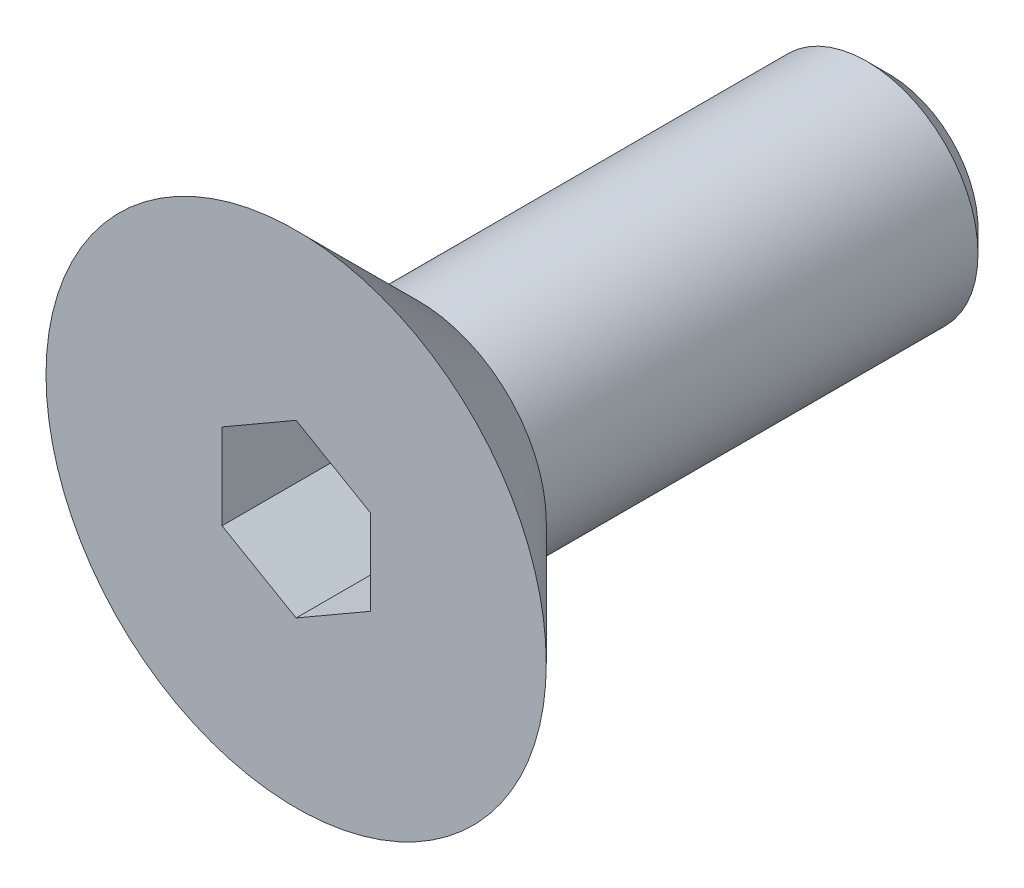
ISO-10303-21;
HEADER;
FILE_DESCRIPTION(('STEP AP214'),'2;1');
FILE_NAME('part.step','',(''),(''),'','','');
FILE_SCHEMA(('AUTOMOTIVE_DESIGN { 1 0 10303 214 1 1 1 1 }'));
ENDSEC;
DATA;
#1=APPLICATION_CONTEXT('core data for automotive mechanical design processes');
#2=APPLICATION_PROTOCOL_DEFINITION('international standard','automotive_design',2000,#1);
#3=PRODUCT_CONTEXT('',#1,'mechanical');
#4=PRODUCT('Part','Part','',(#3));
#5=PRODUCT_RELATED_PRODUCT_CATEGORY('part','',(#4));
#6=PRODUCT_DEFINITION_FORMATION('','',#4);
#7=PRODUCT_DEFINITION_CONTEXT('part definition',#1,'design');
#8=PRODUCT_DEFINITION('design','',#6,#7);
#9=PRODUCT_DEFINITION_SHAPE('','',#8);
#10=(LENGTH_UNIT() NAMED_UNIT(*) SI_UNIT(.MILLI.,.METRE.));
#11=(NAMED_UNIT(*) PLANE_ANGLE_UNIT() SI_UNIT($,.RADIAN.));
#12=(NAMED_UNIT(*) SI_UNIT($,.STERADIAN.) SOLID_ANGLE_UNIT());
#13=UNCERTAINTY_MEASURE_WITH_UNIT(LENGTH_MEASURE(1.E-05),#10,'distance_accuracy_value','');
#14=(GEOMETRIC_REPRESENTATION_CONTEXT(3) GLOBAL_UNCERTAINTY_ASSIGNED_CONTEXT((#13)) GLOBAL_UNIT_ASSIGNED_CONTEXT((#10,
#11,#12)) REPRESENTATION_CONTEXT('',''));
#15=CARTESIAN_POINT('',(0.,0.,0.));
#16=DIRECTION('',(0.,0.,1.));
#17=DIRECTION('',(1.,0.,0.));
#18=AXIS2_PLACEMENT_3D('',#15,#16,#17);
#19=CARTESIAN_POINT('',(0.,0.,0.));
#20=DIRECTION('',(0.,0.,1.));
#21=DIRECTION('',(1.,0.,0.));
#22=AXIS2_PLACEMENT_3D('',#19,#20,#21);
#23=PLANE('',#22);
#24=CARTESIAN_POINT('',(0.,0.,0.));
#25=DIRECTION('',(0.,0.,1.));
#26=DIRECTION('',(1.,0.,0.));
#27=AXIS2_PLACEMENT_3D('',#24,#25,#26);
#28=CIRCLE('',#27,1.725);
#29=CARTESIAN_POINT('',(1.725,0.,0.));
#30=VERTEX_POINT('',#29);
#31=EDGE_CURVE('E11',#30,#30,#28,.F.);
#32=ORIENTED_EDGE('',*,*,#31,.T.);
#33=EDGE_LOOP('',(#32));
#34=FACE_BOUND('',#33,.T.);
#35=CARTESIAN_POINT('',(0.,0.,0.));
#36=DIRECTION('',(0.,0.,1.));
#37=DIRECTION('',(1.,0.,0.));
#38=AXIS2_PLACEMENT_3D('',#35,#36,#37);
#39=CIRCLE('',#38,1.5);
#40=CARTESIAN_POINT('',(1.5,0.,0.));
#41=VERTEX_POINT('',#40);
#42=EDGE_CURVE('E144',#41,#41,#39,.F.);
#43=ORIENTED_EDGE('',*,*,#42,.F.);
#44=EDGE_LOOP('',(#43));
#45=FACE_BOUND('',#44,.T.);
#46=ADVANCED_FACE('F34',(#34,#45),#23,.F.);
#47=CARTESIAN_POINT('',(0.,0.,1.65));
#48=DIRECTION('',(0.,0.,1.));
#49=DIRECTION('',(1.,0.,0.));
#50=AXIS2_PLACEMENT_3D('',#47,#48,#49);
#51=PLANE('',#50);
#52=DIRECTION('',(-0.866025403784439,0.5,0.));
#53=VECTOR('',#52,1.);
#54=CARTESIAN_POINT('',(1.,0.577350269189626,1.65));
#55=LINE('',#54,#53);
#56=CARTESIAN_POINT('',(1.,0.577350269189626,1.65));
#57=VERTEX_POINT('',#56);
#58=CARTESIAN_POINT('',(0.,1.15470053837925,1.65));
#59=VERTEX_POINT('',#58);
#60=EDGE_CURVE('E49',#57,#59,#55,.T.);
#61=ORIENTED_EDGE('',*,*,#60,.F.);
#62=DIRECTION('',(0.,1.,0.));
#63=VECTOR('',#62,1.);
#64=CARTESIAN_POINT('',(1.,-0.577350269189626,1.65));
#65=LINE('',#64,#63);
#66=CARTESIAN_POINT('',(1.,-0.577350269189626,1.65));
#67=VERTEX_POINT('',#66);
#68=EDGE_CURVE('E132',#67,#57,#65,.T.);
#69=ORIENTED_EDGE('',*,*,#68,.F.);
#70=DIRECTION('',(0.866025403784439,0.5,0.));
#71=VECTOR('',#70,1.);
#72=CARTESIAN_POINT('',(0.,-1.15470053837925,1.65));
#73=LINE('',#72,#71);
#74=CARTESIAN_POINT('',(0.,-1.15470053837925,1.65));
#75=VERTEX_POINT('',#74);
#76=EDGE_CURVE('E130',#75,#67,#73,.T.);
#77=ORIENTED_EDGE('',*,*,#76,.F.);
#78=DIRECTION('',(0.866025403784439,-0.5,0.));
#79=VECTOR('',#78,1.);
#80=CARTESIAN_POINT('',(-1.,-0.577350269189626,1.65));
#81=LINE('',#80,#79);
#82=CARTESIAN_POINT('',(-1.,-0.577350269189626,1.65));
#83=VERTEX_POINT('',#82);
#84=EDGE_CURVE('E97',#83,#75,#81,.T.);
#85=ORIENTED_EDGE('',*,*,#84,.F.);
#86=DIRECTION('',(0.,-1.,0.));
#87=VECTOR('',#86,1.);
#88=CARTESIAN_POINT('',(-1.,0.577350269189626,1.65));
#89=LINE('',#88,#87);
#90=CARTESIAN_POINT('',(-1.,0.577350269189626,1.65));
#91=VERTEX_POINT('',#90);
#92=EDGE_CURVE('E126',#91,#83,#89,.T.);
#93=ORIENTED_EDGE('',*,*,#92,.F.);
#94=DIRECTION('',(-0.866025403784439,-0.5,0.));
#95=VECTOR('',#94,1.);
#96=CARTESIAN_POINT('',(0.,1.15470053837925,1.65));
#97=LINE('',#96,#95);
#98=EDGE_CURVE('E123',#59,#91,#97,.T.);
#99=ORIENTED_EDGE('',*,*,#98,.F.);
#100=EDGE_LOOP('',(#61,#69,#77,#85,#93,#99));
#101=FACE_BOUND('',#100,.T.);
#102=CARTESIAN_POINT('',(0.,0.,1.65));
#103=DIRECTION('',(0.,0.,1.));
#104=DIRECTION('',(1.,0.,0.));
#105=AXIS2_PLACEMENT_3D('',#102,#103,#104);
#106=CIRCLE('',#105,3.375);
#107=CARTESIAN_POINT('',(3.375,0.,1.65));
#108=VERTEX_POINT('',#107);
#109=EDGE_CURVE('E136',#108,#108,#106,.T.);
#110=ORIENTED_EDGE('',*,*,#109,.T.);
#111=EDGE_LOOP('',(#110));
#112=FACE_BOUND('',#111,.T.);
#113=ADVANCED_FACE('F167',(#101,#112),#51,.T.);
#114=CARTESIAN_POINT('',(0.,0.,-6.35));
#115=DIRECTION('',(0.,0.,1.));
#116=DIRECTION('',(1.,0.,0.));
#117=AXIS2_PLACEMENT_3D('',#114,#115,#116);
#118=CYLINDRICAL_SURFACE('',#117,1.5);
#119=CARTESIAN_POINT('',(0.,0.,-6.05));
#120=DIRECTION('',(0.,0.,-1.));
#121=DIRECTION('',(-1.,0.,0.));
#122=AXIS2_PLACEMENT_3D('',#119,#120,#121);
#123=CIRCLE('',#122,1.5);
#124=CARTESIAN_POINT('',(-1.5,0.,-6.05));
#125=VERTEX_POINT('',#124);
#126=EDGE_CURVE('E42',#125,#125,#123,.F.);
#127=ORIENTED_EDGE('',*,*,#126,.T.);
#128=EDGE_LOOP('',(#127));
#129=FACE_BOUND('',#128,.T.);
#130=ORIENTED_EDGE('',*,*,#42,.T.);
#131=EDGE_LOOP('',(#130));
#132=FACE_BOUND('',#131,.T.);
#133=ADVANCED_FACE('F152',(#129,#132),#118,.T.);
#134=CARTESIAN_POINT('',(0.,0.,-6.35));
#135=DIRECTION('',(0.,0.,-1.));
#136=DIRECTION('',(-1.,0.,0.));
#137=AXIS2_PLACEMENT_3D('',#134,#135,#136);
#138=PLANE('',#137);
#139=CARTESIAN_POINT('',(0.,0.,-6.35));
#140=DIRECTION('',(0.,0.,-1.));
#141=DIRECTION('',(-1.,0.,0.));
#142=AXIS2_PLACEMENT_3D('',#139,#140,#141);
#143=CIRCLE('',#142,1.2);
#144=CARTESIAN_POINT('',(-1.2,0.,-6.35));
#145=VERTEX_POINT('',#144);
#146=EDGE_CURVE('E147',#145,#145,#143,.T.);
#147=ORIENTED_EDGE('',*,*,#146,.T.);
#148=EDGE_LOOP('',(#147));
#149=FACE_BOUND('',#148,.T.);
#150=ADVANCED_FACE('F159',(#149),#138,.T.);
#151=CARTESIAN_POINT('',(0.,0.,-6.35));
#152=DIRECTION('',(0.,0.,1.));
#153=DIRECTION('',(1.,0.,0.));
#154=AXIS2_PLACEMENT_3D('',#151,#152,#153);
#155=CONICAL_SURFACE('',#154,1.2,0.785398163397447);
#156=ORIENTED_EDGE('',*,*,#126,.F.);
#157=EDGE_LOOP('',(#156));
#158=FACE_BOUND('',#157,.T.);
#159=ORIENTED_EDGE('',*,*,#146,.F.);
#160=EDGE_LOOP('',(#159));
#161=FACE_BOUND('',#160,.T.);
#162=ADVANCED_FACE('F155',(#158,#161),#155,.T.);
#163=CARTESIAN_POINT('',(1.,0.577350269189626,-0.35));
#164=DIRECTION('',(0.5,0.866025403784439,0.));
#165=DIRECTION('',(-0.866025403784439,0.5,0.));
#166=AXIS2_PLACEMENT_3D('',#163,#164,#165);
#167=PLANE('',#166);
#168=ORIENTED_EDGE('',*,*,#60,.T.);
#169=DIRECTION('',(0.,0.,1.));
#170=VECTOR('',#169,1.);
#171=CARTESIAN_POINT('',(0.,1.15470053837925,-0.35));
#172=LINE('',#171,#170);
#173=CARTESIAN_POINT('',(0.,1.15470053837925,-0.35));
#174=VERTEX_POINT('',#173);
#175=EDGE_CURVE('E79',#174,#59,#172,.T.);
#176=ORIENTED_EDGE('',*,*,#175,.F.);
#177=DIRECTION('',(-0.866025403784439,0.5,0.));
#178=VECTOR('',#177,1.);
#179=CARTESIAN_POINT('',(1.,0.577350269189626,-0.35));
#180=LINE('',#179,#178);
#181=CARTESIAN_POINT('',(1.,0.577350269189626,-0.35));
#182=VERTEX_POINT('',#181);
#183=EDGE_CURVE('E134',#182,#174,#180,.T.);
#184=ORIENTED_EDGE('',*,*,#183,.F.);
#185=DIRECTION('',(0.,0.,1.));
#186=VECTOR('',#185,1.);
#187=CARTESIAN_POINT('',(1.,0.577350269189626,-0.35));
#188=LINE('',#187,#186);
#189=EDGE_CURVE('E57',#182,#57,#188,.T.);
#190=ORIENTED_EDGE('',*,*,#189,.T.);
#191=EDGE_LOOP('',(#168,#176,#184,#190));
#192=FACE_BOUND('',#191,.T.);
#193=ADVANCED_FACE('F158',(#192),#167,.F.);
#194=CARTESIAN_POINT('',(1.,-0.577350269189626,-0.35));
#195=DIRECTION('',(1.,0.,0.));
#196=DIRECTION('',(0.,1.,0.));
#197=AXIS2_PLACEMENT_3D('',#194,#195,#196);
#198=PLANE('',#197);
#199=ORIENTED_EDGE('',*,*,#68,.T.);
#200=ORIENTED_EDGE('',*,*,#189,.F.);
#201=DIRECTION('',(0.,1.,0.));
#202=VECTOR('',#201,1.);
#203=CARTESIAN_POINT('',(1.,-0.577350269189626,-0.35));
#204=LINE('',#203,#202);
#205=CARTESIAN_POINT('',(1.,-0.577350269189626,-0.35));
#206=VERTEX_POINT('',#205);
#207=EDGE_CURVE('E109',#206,#182,#204,.T.);
#208=ORIENTED_EDGE('',*,*,#207,.F.);
#209=DIRECTION('',(0.,0.,1.));
#210=VECTOR('',#209,1.);
#211=CARTESIAN_POINT('',(1.,-0.577350269189626,-0.35));
#212=LINE('',#211,#210);
#213=EDGE_CURVE('E101',#206,#67,#212,.T.);
#214=ORIENTED_EDGE('',*,*,#213,.T.);
#215=EDGE_LOOP('',(#199,#200,#208,#214));
#216=FACE_BOUND('',#215,.T.);
#217=ADVANCED_FACE('F198',(#216),#198,.F.);
#218=CARTESIAN_POINT('',(0.,-1.15470053837925,-0.35));
#219=DIRECTION('',(0.5,-0.866025403784439,0.));
#220=DIRECTION('',(0.866025403784439,0.5,0.));
#221=AXIS2_PLACEMENT_3D('',#218,#219,#220);
#222=PLANE('',#221);
#223=ORIENTED_EDGE('',*,*,#76,.T.);
#224=ORIENTED_EDGE('',*,*,#213,.F.);
#225=DIRECTION('',(0.866025403784439,0.5,0.));
#226=VECTOR('',#225,1.);
#227=CARTESIAN_POINT('',(0.,-1.15470053837925,-0.35));
#228=LINE('',#227,#226);
#229=CARTESIAN_POINT('',(0.,-1.15470053837925,-0.35));
#230=VERTEX_POINT('',#229);
#231=EDGE_CURVE('E105',#230,#206,#228,.T.);
#232=ORIENTED_EDGE('',*,*,#231,.F.);
#233=DIRECTION('',(0.,0.,1.));
#234=VECTOR('',#233,1.);
#235=CARTESIAN_POINT('',(0.,-1.15470053837925,-0.35));
#236=LINE('',#235,#234);
#237=EDGE_CURVE('E90',#230,#75,#236,.T.);
#238=ORIENTED_EDGE('',*,*,#237,.T.);
#239=EDGE_LOOP('',(#223,#224,#232,#238));
#240=FACE_BOUND('',#239,.T.);
#241=ADVANCED_FACE('F106',(#240),#222,.F.);
#242=CARTESIAN_POINT('',(-1.,-0.577350269189626,-0.35));
#243=DIRECTION('',(-0.5,-0.866025403784439,0.));
#244=DIRECTION('',(0.866025403784439,-0.5,0.));
#245=AXIS2_PLACEMENT_3D('',#242,#243,#244);
#246=PLANE('',#245);
#247=ORIENTED_EDGE('',*,*,#84,.T.);
#248=ORIENTED_EDGE('',*,*,#237,.F.);
#249=DIRECTION('',(0.866025403784439,-0.5,0.));
#250=VECTOR('',#249,1.);
#251=CARTESIAN_POINT('',(-1.,-0.577350269189626,-0.35));
#252=LINE('',#251,#250);
#253=CARTESIAN_POINT('',(-1.,-0.577350269189626,-0.35));
#254=VERTEX_POINT('',#253);
#255=EDGE_CURVE('E94',#254,#230,#252,.T.);
#256=ORIENTED_EDGE('',*,*,#255,.F.);
#257=DIRECTION('',(0.,0.,1.));
#258=VECTOR('',#257,1.);
#259=CARTESIAN_POINT('',(-1.,-0.577350269189626,-0.35));
#260=LINE('',#259,#258);
#261=EDGE_CURVE('E102',#254,#83,#260,.T.);
#262=ORIENTED_EDGE('',*,*,#261,.T.);
#263=EDGE_LOOP('',(#247,#248,#256,#262));
#264=FACE_BOUND('',#263,.T.);
#265=ADVANCED_FACE('F92',(#264),#246,.F.);
#266=CARTESIAN_POINT('',(-1.,0.577350269189626,-0.35));
#267=DIRECTION('',(-1.,0.,0.));
#268=DIRECTION('',(0.,-1.,0.));
#269=AXIS2_PLACEMENT_3D('',#266,#267,#268);
#270=PLANE('',#269);
#271=ORIENTED_EDGE('',*,*,#92,.T.);
#272=ORIENTED_EDGE('',*,*,#261,.F.);
#273=DIRECTION('',(0.,-1.,0.));
#274=VECTOR('',#273,1.);
#275=CARTESIAN_POINT('',(-1.,0.577350269189626,-0.35));
#276=LINE('',#275,#274);
#277=CARTESIAN_POINT('',(-1.,0.577350269189626,-0.35));
#278=VERTEX_POINT('',#277);
#279=EDGE_CURVE('E115',#278,#254,#276,.T.);
#280=ORIENTED_EDGE('',*,*,#279,.F.);
#281=DIRECTION('',(0.,0.,1.));
#282=VECTOR('',#281,1.);
#283=CARTESIAN_POINT('',(-1.,0.577350269189626,-0.35));
#284=LINE('',#283,#282);
#285=EDGE_CURVE('E139',#278,#91,#284,.T.);
#286=ORIENTED_EDGE('',*,*,#285,.T.);
#287=EDGE_LOOP('',(#271,#272,#280,#286));
#288=FACE_BOUND('',#287,.T.);
#289=ADVANCED_FACE('F194',(#288),#270,.F.);
#290=CARTESIAN_POINT('',(0.,1.15470053837925,-0.35));
#291=DIRECTION('',(-0.5,0.866025403784439,0.));
#292=DIRECTION('',(-0.866025403784439,-0.5,0.));
#293=AXIS2_PLACEMENT_3D('',#290,#291,#292);
#294=PLANE('',#293);
#295=ORIENTED_EDGE('',*,*,#98,.T.);
#296=ORIENTED_EDGE('',*,*,#285,.F.);
#297=DIRECTION('',(-0.866025403784439,-0.5,0.));
#298=VECTOR('',#297,1.);
#299=CARTESIAN_POINT('',(0.,1.15470053837925,-0.35));
#300=LINE('',#299,#298);
#301=EDGE_CURVE('E117',#174,#278,#300,.T.);
#302=ORIENTED_EDGE('',*,*,#301,.F.);
#303=ORIENTED_EDGE('',*,*,#175,.T.);
#304=EDGE_LOOP('',(#295,#296,#302,#303));
#305=FACE_BOUND('',#304,.T.);
#306=ADVANCED_FACE('F189',(#305),#294,.F.);
#307=CARTESIAN_POINT('',(0.,0.,-0.35));
#308=DIRECTION('',(0.,0.,1.));
#309=DIRECTION('',(1.,0.,0.));
#310=AXIS2_PLACEMENT_3D('',#307,#308,#309);
#311=PLANE('',#310);
#312=ORIENTED_EDGE('',*,*,#183,.T.);
#313=ORIENTED_EDGE('',*,*,#301,.T.);
#314=ORIENTED_EDGE('',*,*,#279,.T.);
#315=ORIENTED_EDGE('',*,*,#255,.T.);
#316=ORIENTED_EDGE('',*,*,#231,.T.);
#317=ORIENTED_EDGE('',*,*,#207,.T.);
#318=EDGE_LOOP('',(#312,#313,#314,#315,#316,#317));
#319=FACE_BOUND('',#318,.T.);
#320=ADVANCED_FACE('F112',(#319),#311,.T.);
#321=CARTESIAN_POINT('',(0.,0.,1.65));
#322=DIRECTION('',(0.,0.,1.));
#323=DIRECTION('',(1.,0.,0.));
#324=AXIS2_PLACEMENT_3D('',#321,#322,#323);
#325=CONICAL_SURFACE('',#324,3.375,0.78539816339745);
#326=ORIENTED_EDGE('',*,*,#31,.F.);
#327=EDGE_LOOP('',(#326));
#328=FACE_BOUND('',#327,.T.);
#329=ORIENTED_EDGE('',*,*,#109,.F.);
#330=EDGE_LOOP('',(#329));
#331=FACE_BOUND('',#330,.T.);
#332=ADVANCED_FACE('F36',(#328,#331),#325,.T.);
#333=CLOSED_SHELL('',(#46,#113,#133,#150,#162,#193,#217,#241,#265,#289,#306,#320,#332));
#334=MANIFOLD_SOLID_BREP('B2',#333);
#335=ADVANCED_BREP_SHAPE_REPRESENTATION('',(#18,#334),#14);
#336=SHAPE_DEFINITION_REPRESENTATION(#9,#335);
ENDSEC;
END-ISO-10303-21;
